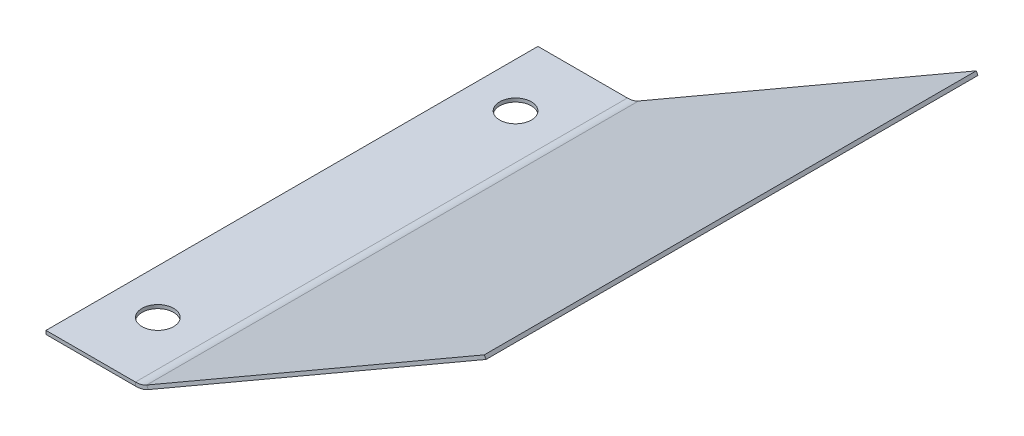
ISO-10303-21;
HEADER;
FILE_DESCRIPTION(('STEP AP214'),'2;1');
FILE_NAME('part.step','',(''),(''),'','','');
FILE_SCHEMA(('AUTOMOTIVE_DESIGN { 1 0 10303 214 1 1 1 1 }'));
ENDSEC;
DATA;
#1=APPLICATION_CONTEXT('core data for automotive mechanical design processes');
#2=APPLICATION_PROTOCOL_DEFINITION('international standard','automotive_design',2000,#1);
#3=PRODUCT_CONTEXT('',#1,'mechanical');
#4=PRODUCT('Part','Part','',(#3));
#5=PRODUCT_RELATED_PRODUCT_CATEGORY('part','',(#4));
#6=PRODUCT_DEFINITION_FORMATION('','',#4);
#7=PRODUCT_DEFINITION_CONTEXT('part definition',#1,'design');
#8=PRODUCT_DEFINITION('design','',#6,#7);
#9=PRODUCT_DEFINITION_SHAPE('','',#8);
#10=(LENGTH_UNIT() NAMED_UNIT(*) SI_UNIT(.MILLI.,.METRE.));
#11=(NAMED_UNIT(*) PLANE_ANGLE_UNIT() SI_UNIT($,.RADIAN.));
#12=(NAMED_UNIT(*) SI_UNIT($,.STERADIAN.) SOLID_ANGLE_UNIT());
#13=UNCERTAINTY_MEASURE_WITH_UNIT(LENGTH_MEASURE(1.E-05),#10,'distance_accuracy_value','');
#14=(GEOMETRIC_REPRESENTATION_CONTEXT(3) GLOBAL_UNCERTAINTY_ASSIGNED_CONTEXT((#13)) GLOBAL_UNIT_ASSIGNED_CONTEXT((#10,
#11,#12)) REPRESENTATION_CONTEXT('',''));
#15=CARTESIAN_POINT('',(0.,0.,0.));
#16=DIRECTION('',(0.,0.,1.));
#17=DIRECTION('',(1.,0.,0.));
#18=AXIS2_PLACEMENT_3D('',#15,#16,#17);
#19=CARTESIAN_POINT('',(0.,0.,0.));
#20=DIRECTION('',(0.,1.,0.));
#21=DIRECTION('',(0.,0.,1.));
#22=AXIS2_PLACEMENT_3D('',#19,#20,#21);
#23=PLANE('',#22);
#24=CARTESIAN_POINT('',(-6.34999999999999,0.,-60.325));
#25=DIRECTION('',(0.,-1.,0.));
#26=DIRECTION('',(0.,0.,-1.));
#27=AXIS2_PLACEMENT_3D('',#24,#25,#26);
#28=CIRCLE('',#27,2.2479);
#29=CARTESIAN_POINT('',(-6.34999999999999,0.,-62.5729));
#30=VERTEX_POINT('',#29);
#31=EDGE_CURVE('E219',#30,#30,#28,.T.);
#32=ORIENTED_EDGE('',*,*,#31,.F.);
#33=EDGE_LOOP('',(#32));
#34=FACE_BOUND('',#33,.T.);
#35=DIRECTION('',(0.,0.,1.));
#36=VECTOR('',#35,1.);
#37=CARTESIAN_POINT('',(0.,0.,0.));
#38=LINE('',#37,#36);
#39=CARTESIAN_POINT('',(0.,0.,0.));
#40=VERTEX_POINT('',#39);
#41=CARTESIAN_POINT('',(0.,0.,-69.85));
#42=VERTEX_POINT('',#41);
#43=EDGE_CURVE('E145',#40,#42,#38,.F.);
#44=ORIENTED_EDGE('',*,*,#43,.F.);
#45=DIRECTION('',(1.,0.,0.));
#46=VECTOR('',#45,1.);
#47=CARTESIAN_POINT('',(0.,0.,0.));
#48=LINE('',#47,#46);
#49=CARTESIAN_POINT('',(-12.7,0.,0.));
#50=VERTEX_POINT('',#49);
#51=EDGE_CURVE('E149',#50,#40,#48,.T.);
#52=ORIENTED_EDGE('',*,*,#51,.F.);
#53=DIRECTION('',(0.,0.,1.));
#54=VECTOR('',#53,1.);
#55=CARTESIAN_POINT('',(-12.7,0.,0.));
#56=LINE('',#55,#54);
#57=CARTESIAN_POINT('',(-12.7,0.,-69.85));
#58=VERTEX_POINT('',#57);
#59=EDGE_CURVE('E151',#58,#50,#56,.T.);
#60=ORIENTED_EDGE('',*,*,#59,.F.);
#61=DIRECTION('',(1.,0.,0.));
#62=VECTOR('',#61,1.);
#63=CARTESIAN_POINT('',(0.,0.,-69.85));
#64=LINE('',#63,#62);
#65=EDGE_CURVE('E113',#42,#58,#64,.F.);
#66=ORIENTED_EDGE('',*,*,#65,.F.);
#67=EDGE_LOOP('',(#44,#52,#60,#66));
#68=FACE_BOUND('',#67,.T.);
#69=CARTESIAN_POINT('',(-6.34999999999998,0.,-9.52499999999999));
#70=DIRECTION('',(0.,-1.,0.));
#71=DIRECTION('',(0.,0.,-1.));
#72=AXIS2_PLACEMENT_3D('',#69,#70,#71);
#73=CIRCLE('',#72,2.2479);
#74=CARTESIAN_POINT('',(-6.34999999999998,0.,-11.7729));
#75=VERTEX_POINT('',#74);
#76=EDGE_CURVE('E213',#75,#75,#73,.T.);
#77=ORIENTED_EDGE('',*,*,#76,.F.);
#78=EDGE_LOOP('',(#77));
#79=FACE_BOUND('',#78,.T.);
#80=ADVANCED_FACE('F72',(#34,#68,#79),#23,.F.);
#81=CARTESIAN_POINT('',(-12.7,0.508,0.));
#82=DIRECTION('',(-1.,0.,0.));
#83=DIRECTION('',(0.,0.,1.));
#84=AXIS2_PLACEMENT_3D('',#81,#82,#83);
#85=PLANE('',#84);
#86=DIRECTION('',(0.,1.,0.));
#87=VECTOR('',#86,1.);
#88=CARTESIAN_POINT('',(-12.7,0.508,-69.85));
#89=LINE('',#88,#87);
#90=CARTESIAN_POINT('',(-12.7,0.508,-69.85));
#91=VERTEX_POINT('',#90);
#92=EDGE_CURVE('E15',#58,#91,#89,.T.);
#93=ORIENTED_EDGE('',*,*,#92,.F.);
#94=ORIENTED_EDGE('',*,*,#59,.T.);
#95=DIRECTION('',(0.,1.,0.));
#96=VECTOR('',#95,1.);
#97=CARTESIAN_POINT('',(-12.7,0.508,0.));
#98=LINE('',#97,#96);
#99=CARTESIAN_POINT('',(-12.7,0.508,0.));
#100=VERTEX_POINT('',#99);
#101=EDGE_CURVE('E82',#50,#100,#98,.T.);
#102=ORIENTED_EDGE('',*,*,#101,.T.);
#103=DIRECTION('',(0.,0.,1.));
#104=VECTOR('',#103,1.);
#105=CARTESIAN_POINT('',(-12.7,0.508,0.));
#106=LINE('',#105,#104);
#107=EDGE_CURVE('E135',#91,#100,#106,.T.);
#108=ORIENTED_EDGE('',*,*,#107,.F.);
#109=EDGE_LOOP('',(#93,#94,#102,#108));
#110=FACE_BOUND('',#109,.T.);
#111=ADVANCED_FACE('F139',(#110),#85,.T.);
#112=CARTESIAN_POINT('',(0.,0.508,0.));
#113=DIRECTION('',(0.,0.,1.));
#114=DIRECTION('',(1.,0.,0.));
#115=AXIS2_PLACEMENT_3D('',#112,#113,#114);
#116=PLANE('',#115);
#117=ORIENTED_EDGE('',*,*,#101,.F.);
#118=ORIENTED_EDGE('',*,*,#51,.T.);
#119=DIRECTION('',(0.,1.,0.));
#120=VECTOR('',#119,1.);
#121=CARTESIAN_POINT('',(0.,0.508,0.));
#122=LINE('',#121,#120);
#123=CARTESIAN_POINT('',(0.,0.508,0.));
#124=VERTEX_POINT('',#123);
#125=EDGE_CURVE('E90',#40,#124,#122,.T.);
#126=ORIENTED_EDGE('',*,*,#125,.T.);
#127=DIRECTION('',(1.,0.,0.));
#128=VECTOR('',#127,1.);
#129=CARTESIAN_POINT('',(0.,0.508,0.));
#130=LINE('',#129,#128);
#131=EDGE_CURVE('E140',#100,#124,#130,.T.);
#132=ORIENTED_EDGE('',*,*,#131,.F.);
#133=EDGE_LOOP('',(#117,#118,#126,#132));
#134=FACE_BOUND('',#133,.T.);
#135=ADVANCED_FACE('F249',(#134),#116,.T.);
#136=CARTESIAN_POINT('',(0.,0.508,-69.85));
#137=DIRECTION('',(0.,0.,-1.));
#138=DIRECTION('',(-1.,0.,0.));
#139=AXIS2_PLACEMENT_3D('',#136,#137,#138);
#140=PLANE('',#139);
#141=ORIENTED_EDGE('',*,*,#65,.T.);
#142=ORIENTED_EDGE('',*,*,#92,.T.);
#143=DIRECTION('',(-1.,0.,0.));
#144=VECTOR('',#143,1.);
#145=CARTESIAN_POINT('',(0.,0.508,-69.85));
#146=LINE('',#145,#144);
#147=CARTESIAN_POINT('',(0.,0.508,-69.85));
#148=VERTEX_POINT('',#147);
#149=EDGE_CURVE('E130',#148,#91,#146,.T.);
#150=ORIENTED_EDGE('',*,*,#149,.F.);
#151=DIRECTION('',(0.,1.,0.));
#152=VECTOR('',#151,1.);
#153=CARTESIAN_POINT('',(0.,0.508,-69.85));
#154=LINE('',#153,#152);
#155=EDGE_CURVE('E76',#42,#148,#154,.T.);
#156=ORIENTED_EDGE('',*,*,#155,.F.);
#157=EDGE_LOOP('',(#141,#142,#150,#156));
#158=FACE_BOUND('',#157,.T.);
#159=ADVANCED_FACE('F74',(#158),#140,.T.);
#160=CARTESIAN_POINT('',(0.,0.508,0.));
#161=DIRECTION('',(0.,1.,0.));
#162=DIRECTION('',(0.,0.,1.));
#163=AXIS2_PLACEMENT_3D('',#160,#161,#162);
#164=PLANE('',#163);
#165=CARTESIAN_POINT('',(-6.34999999999999,0.508,-60.325));
#166=DIRECTION('',(0.,1.,0.));
#167=DIRECTION('',(0.,0.,1.));
#168=AXIS2_PLACEMENT_3D('',#165,#166,#167);
#169=CIRCLE('',#168,2.2479);
#170=CARTESIAN_POINT('',(-6.34999999999999,0.508,-58.0771));
#171=VERTEX_POINT('',#170);
#172=EDGE_CURVE('E216',#171,#171,#169,.T.);
#173=ORIENTED_EDGE('',*,*,#172,.F.);
#174=EDGE_LOOP('',(#173));
#175=FACE_BOUND('',#174,.T.);
#176=CARTESIAN_POINT('',(-6.34999999999998,0.508,-9.52499999999999));
#177=DIRECTION('',(0.,1.,0.));
#178=DIRECTION('',(0.,0.,1.));
#179=AXIS2_PLACEMENT_3D('',#176,#177,#178);
#180=CIRCLE('',#179,2.2479);
#181=CARTESIAN_POINT('',(-6.34999999999998,0.508,-7.27709999999999));
#182=VERTEX_POINT('',#181);
#183=EDGE_CURVE('E185',#182,#182,#180,.T.);
#184=ORIENTED_EDGE('',*,*,#183,.F.);
#185=EDGE_LOOP('',(#184));
#186=FACE_BOUND('',#185,.T.);
#187=DIRECTION('',(0.,0.,-1.));
#188=VECTOR('',#187,1.);
#189=CARTESIAN_POINT('',(0.,0.508,0.));
#190=LINE('',#189,#188);
#191=EDGE_CURVE('E137',#124,#148,#190,.T.);
#192=ORIENTED_EDGE('',*,*,#191,.T.);
#193=ORIENTED_EDGE('',*,*,#149,.T.);
#194=ORIENTED_EDGE('',*,*,#107,.T.);
#195=ORIENTED_EDGE('',*,*,#131,.T.);
#196=EDGE_LOOP('',(#192,#193,#194,#195));
#197=FACE_BOUND('',#196,.T.);
#198=ADVANCED_FACE('F134',(#175,#186,#197),#164,.T.);
#199=CARTESIAN_POINT('',(0.,3.683,0.));
#200=DIRECTION('',(0.,0.,1.));
#201=DIRECTION('',(0.,-1.,0.));
#202=AXIS2_PLACEMENT_3D('',#199,#200,#201);
#203=PLANE('',#202);
#204=DIRECTION('',(-0.499999999999995,0.866025403784442,0.));
#205=VECTOR('',#204,1.);
#206=CARTESIAN_POINT('',(1.84149999999997,0.493428437861901,0.));
#207=LINE('',#206,#205);
#208=CARTESIAN_POINT('',(1.58749999999999,0.933369342984402,0.));
#209=VERTEX_POINT('',#208);
#210=CARTESIAN_POINT('',(1.84149999999997,0.493428437861906,0.));
#211=VERTEX_POINT('',#210);
#212=EDGE_CURVE('E182',#209,#211,#207,.F.);
#213=ORIENTED_EDGE('',*,*,#212,.F.);
#214=CARTESIAN_POINT('',(0.,3.683,0.));
#215=DIRECTION('',(0.,0.,-1.));
#216=DIRECTION('',(0.,1.,0.));
#217=AXIS2_PLACEMENT_3D('',#214,#215,#216);
#218=CIRCLE('',#217,3.175);
#219=EDGE_CURVE('E171',#124,#209,#218,.F.);
#220=ORIENTED_EDGE('',*,*,#219,.F.);
#221=ORIENTED_EDGE('',*,*,#125,.F.);
#222=CARTESIAN_POINT('',(0.,3.683,0.));
#223=DIRECTION('',(0.,0.,-1.));
#224=DIRECTION('',(0.,1.,0.));
#225=AXIS2_PLACEMENT_3D('',#222,#223,#224);
#226=CIRCLE('',#225,3.683);
#227=EDGE_CURVE('E148',#40,#211,#226,.F.);
#228=ORIENTED_EDGE('',*,*,#227,.T.);
#229=EDGE_LOOP('',(#213,#220,#221,#228));
#230=FACE_BOUND('',#229,.T.);
#231=ADVANCED_FACE('F240',(#230),#203,.T.);
#232=CARTESIAN_POINT('',(0.,3.683,-69.85));
#233=DIRECTION('',(0.,0.,1.));
#234=DIRECTION('',(0.,-1.,0.));
#235=AXIS2_PLACEMENT_3D('',#232,#233,#234);
#236=PLANE('',#235);
#237=CARTESIAN_POINT('',(0.,3.683,-69.85));
#238=DIRECTION('',(0.,0.,-1.));
#239=DIRECTION('',(0.,1.,0.));
#240=AXIS2_PLACEMENT_3D('',#237,#238,#239);
#241=CIRCLE('',#240,3.175);
#242=CARTESIAN_POINT('',(1.58749999999999,0.933369342984397,-69.85));
#243=VERTEX_POINT('',#242);
#244=EDGE_CURVE('E161',#243,#148,#241,.T.);
#245=ORIENTED_EDGE('',*,*,#244,.F.);
#246=DIRECTION('',(-0.499999999999995,0.866025403784442,0.));
#247=VECTOR('',#246,1.);
#248=CARTESIAN_POINT('',(1.58749999999999,0.933369342984398,-69.85));
#249=LINE('',#248,#247);
#250=CARTESIAN_POINT('',(1.8415,0.493428437861905,-69.85));
#251=VERTEX_POINT('',#250);
#252=EDGE_CURVE('E187',#243,#251,#249,.F.);
#253=ORIENTED_EDGE('',*,*,#252,.T.);
#254=CARTESIAN_POINT('',(0.,3.683,-69.85));
#255=DIRECTION('',(0.,0.,-1.));
#256=DIRECTION('',(0.,1.,0.));
#257=AXIS2_PLACEMENT_3D('',#254,#255,#256);
#258=CIRCLE('',#257,3.683);
#259=EDGE_CURVE('E164',#251,#42,#258,.T.);
#260=ORIENTED_EDGE('',*,*,#259,.T.);
#261=ORIENTED_EDGE('',*,*,#155,.T.);
#262=EDGE_LOOP('',(#245,#253,#260,#261));
#263=FACE_BOUND('',#262,.T.);
#264=ADVANCED_FACE('F159',(#263),#236,.F.);
#265=CARTESIAN_POINT('',(0.,3.683,-69.85));
#266=DIRECTION('',(0.,0.,-1.));
#267=DIRECTION('',(0.499999999999995,-0.866025403784442,0.));
#268=AXIS2_PLACEMENT_3D('',#265,#266,#267);
#269=CYLINDRICAL_SURFACE('',#268,3.683);
#270=ORIENTED_EDGE('',*,*,#43,.T.);
#271=ORIENTED_EDGE('',*,*,#259,.F.);
#272=DIRECTION('',(0.,0.,-1.));
#273=VECTOR('',#272,1.);
#274=CARTESIAN_POINT('',(1.84149999999997,0.493428437861905,0.));
#275=LINE('',#274,#273);
#276=EDGE_CURVE('E189',#251,#211,#275,.F.);
#277=ORIENTED_EDGE('',*,*,#276,.T.);
#278=ORIENTED_EDGE('',*,*,#227,.F.);
#279=EDGE_LOOP('',(#270,#271,#277,#278));
#280=FACE_BOUND('',#279,.T.);
#281=ADVANCED_FACE('F292',(#280),#269,.T.);
#282=CARTESIAN_POINT('',(0.,3.683,-69.85));
#283=DIRECTION('',(0.,0.,-1.));
#284=DIRECTION('',(0.499999999999995,-0.866025403784442,0.));
#285=AXIS2_PLACEMENT_3D('',#282,#283,#284);
#286=CYLINDRICAL_SURFACE('',#285,3.175);
#287=ORIENTED_EDGE('',*,*,#191,.F.);
#288=ORIENTED_EDGE('',*,*,#219,.T.);
#289=DIRECTION('',(0.,0.,-1.));
#290=VECTOR('',#289,1.);
#291=CARTESIAN_POINT('',(1.58749999999999,0.933369342984402,0.));
#292=LINE('',#291,#290);
#293=EDGE_CURVE('E170',#209,#243,#292,.T.);
#294=ORIENTED_EDGE('',*,*,#293,.T.);
#295=ORIENTED_EDGE('',*,*,#244,.T.);
#296=EDGE_LOOP('',(#287,#288,#294,#295));
#297=FACE_BOUND('',#296,.T.);
#298=ADVANCED_FACE('F166',(#297),#286,.F.);
#299=CARTESIAN_POINT('',(49.784199837773,28.1731590948772,-69.85));
#300=DIRECTION('',(0.,0.,1.));
#301=DIRECTION('',(1.,0.,0.));
#302=AXIS2_PLACEMENT_3D('',#299,#300,#301);
#303=PLANE('',#302);
#304=ORIENTED_EDGE('',*,*,#252,.F.);
#305=DIRECTION('',(-0.866025403784442,-0.499999999999995,0.));
#306=VECTOR('',#305,1.);
#307=CARTESIAN_POINT('',(49.530199837773,28.6130999999997,-69.85));
#308=LINE('',#307,#306);
#309=CARTESIAN_POINT('',(49.530199837773,28.6130999999997,-69.85));
#310=VERTEX_POINT('',#309);
#311=EDGE_CURVE('E191',#243,#310,#308,.F.);
#312=ORIENTED_EDGE('',*,*,#311,.T.);
#313=DIRECTION('',(-0.499999999999995,0.866025403784442,0.));
#314=VECTOR('',#313,1.);
#315=CARTESIAN_POINT('',(49.784199837773,28.1731590948772,-69.85));
#316=LINE('',#315,#314);
#317=CARTESIAN_POINT('',(49.784199837773,28.1731590948772,-69.85));
#318=VERTEX_POINT('',#317);
#319=EDGE_CURVE('E172',#318,#310,#316,.T.);
#320=ORIENTED_EDGE('',*,*,#319,.F.);
#321=DIRECTION('',(0.866025403784442,0.499999999999995,0.));
#322=VECTOR('',#321,1.);
#323=CARTESIAN_POINT('',(0.884768233407551,-0.0589409051224901,-69.85));
#324=LINE('',#323,#322);
#325=EDGE_CURVE('E200',#251,#318,#324,.T.);
#326=ORIENTED_EDGE('',*,*,#325,.F.);
#327=EDGE_LOOP('',(#304,#312,#320,#326));
#328=FACE_BOUND('',#327,.T.);
#329=ADVANCED_FACE('F309',(#328),#303,.F.);
#330=CARTESIAN_POINT('',(1.1047386859688,0.0680590948775037,0.));
#331=DIRECTION('',(0.,0.,-1.));
#332=DIRECTION('',(-1.,0.,0.));
#333=AXIS2_PLACEMENT_3D('',#330,#331,#332);
#334=PLANE('',#333);
#335=ORIENTED_EDGE('',*,*,#212,.T.);
#336=DIRECTION('',(-0.866025403784442,-0.499999999999995,0.));
#337=VECTOR('',#336,1.);
#338=CARTESIAN_POINT('',(0.884768233407551,-0.0589409051224899,0.));
#339=LINE('',#338,#337);
#340=CARTESIAN_POINT('',(49.784199837773,28.1731590948772,0.));
#341=VERTEX_POINT('',#340);
#342=EDGE_CURVE('E206',#341,#211,#339,.T.);
#343=ORIENTED_EDGE('',*,*,#342,.F.);
#344=DIRECTION('',(-0.499999999999995,0.866025403784442,0.));
#345=VECTOR('',#344,1.);
#346=CARTESIAN_POINT('',(49.784199837773,28.1731590948772,0.));
#347=LINE('',#346,#345);
#348=CARTESIAN_POINT('',(49.5301998377731,28.6130999999997,0.));
#349=VERTEX_POINT('',#348);
#350=EDGE_CURVE('E176',#341,#349,#347,.T.);
#351=ORIENTED_EDGE('',*,*,#350,.T.);
#352=DIRECTION('',(0.866025403784442,0.499999999999995,0.));
#353=VECTOR('',#352,1.);
#354=CARTESIAN_POINT('',(0.850738685968799,0.508000000000004,0.));
#355=LINE('',#354,#353);
#356=EDGE_CURVE('E197',#349,#209,#355,.F.);
#357=ORIENTED_EDGE('',*,*,#356,.T.);
#358=EDGE_LOOP('',(#335,#343,#351,#357));
#359=FACE_BOUND('',#358,.T.);
#360=ADVANCED_FACE('F318',(#359),#334,.F.);
#361=CARTESIAN_POINT('',(0.884768233407551,-0.0589409051224899,0.));
#362=DIRECTION('',(-0.499999999999995,0.866025403784442,0.));
#363=DIRECTION('',(-0.866025403784442,-0.499999999999995,0.));
#364=AXIS2_PLACEMENT_3D('',#361,#362,#363);
#365=PLANE('',#364);
#366=ORIENTED_EDGE('',*,*,#276,.F.);
#367=ORIENTED_EDGE('',*,*,#325,.T.);
#368=DIRECTION('',(0.,0.,1.));
#369=VECTOR('',#368,1.);
#370=CARTESIAN_POINT('',(49.784199837773,28.1731590948772,0.));
#371=LINE('',#370,#369);
#372=EDGE_CURVE('E203',#318,#341,#371,.T.);
#373=ORIENTED_EDGE('',*,*,#372,.T.);
#374=ORIENTED_EDGE('',*,*,#342,.T.);
#375=EDGE_LOOP('',(#366,#367,#373,#374));
#376=FACE_BOUND('',#375,.T.);
#377=ADVANCED_FACE('F328',(#376),#365,.F.);
#378=CARTESIAN_POINT('',(0.630768233407547,0.381000000000006,0.));
#379=DIRECTION('',(-0.499999999999995,0.866025403784442,0.));
#380=DIRECTION('',(-0.866025403784442,-0.499999999999995,0.));
#381=AXIS2_PLACEMENT_3D('',#378,#379,#380);
#382=PLANE('',#381);
#383=ORIENTED_EDGE('',*,*,#311,.F.);
#384=ORIENTED_EDGE('',*,*,#293,.F.);
#385=ORIENTED_EDGE('',*,*,#356,.F.);
#386=DIRECTION('',(0.,0.,-1.));
#387=VECTOR('',#386,1.);
#388=CARTESIAN_POINT('',(49.5301998377731,28.6130999999997,0.));
#389=LINE('',#388,#387);
#390=EDGE_CURVE('E194',#310,#349,#389,.F.);
#391=ORIENTED_EDGE('',*,*,#390,.F.);
#392=EDGE_LOOP('',(#383,#384,#385,#391));
#393=FACE_BOUND('',#392,.T.);
#394=ADVANCED_FACE('F338',(#393),#382,.T.);
#395=CARTESIAN_POINT('',(49.784199837773,28.1731590948772,0.));
#396=DIRECTION('',(-0.866025403784442,-0.499999999999995,0.));
#397=DIRECTION('',(0.499999999999995,-0.866025403784442,0.));
#398=AXIS2_PLACEMENT_3D('',#395,#396,#397);
#399=PLANE('',#398);
#400=ORIENTED_EDGE('',*,*,#390,.T.);
#401=ORIENTED_EDGE('',*,*,#350,.F.);
#402=ORIENTED_EDGE('',*,*,#372,.F.);
#403=ORIENTED_EDGE('',*,*,#319,.T.);
#404=EDGE_LOOP('',(#400,#401,#402,#403));
#405=FACE_BOUND('',#404,.T.);
#406=ADVANCED_FACE('F235',(#405),#399,.F.);
#407=CARTESIAN_POINT('',(-6.34999999999998,0.,-9.52499999999999));
#408=DIRECTION('',(0.,-1.,0.));
#409=DIRECTION('',(0.,0.,-1.));
#410=AXIS2_PLACEMENT_3D('',#407,#408,#409);
#411=CYLINDRICAL_SURFACE('',#410,2.2479);
#412=ORIENTED_EDGE('',*,*,#76,.T.);
#413=EDGE_LOOP('',(#412));
#414=FACE_BOUND('',#413,.T.);
#415=ORIENTED_EDGE('',*,*,#183,.T.);
#416=EDGE_LOOP('',(#415));
#417=FACE_BOUND('',#416,.T.);
#418=ADVANCED_FACE('F232',(#414,#417),#411,.F.);
#419=CARTESIAN_POINT('',(-6.34999999999999,0.,-60.325));
#420=DIRECTION('',(0.,-1.,0.));
#421=DIRECTION('',(0.,0.,-1.));
#422=AXIS2_PLACEMENT_3D('',#419,#420,#421);
#423=CYLINDRICAL_SURFACE('',#422,2.2479);
#424=ORIENTED_EDGE('',*,*,#31,.T.);
#425=EDGE_LOOP('',(#424));
#426=FACE_BOUND('',#425,.T.);
#427=ORIENTED_EDGE('',*,*,#172,.T.);
#428=EDGE_LOOP('',(#427));
#429=FACE_BOUND('',#428,.T.);
#430=ADVANCED_FACE('F223',(#426,#429),#423,.F.);
#431=CLOSED_SHELL('',(#80,#111,#135,#159,#198,#231,#264,#281,#298,#329,#360,#377,#394,#406,#418,#430));
#432=MANIFOLD_SOLID_BREP('B2',#431);
#433=ADVANCED_BREP_SHAPE_REPRESENTATION('',(#18,#432),#14);
#434=SHAPE_DEFINITION_REPRESENTATION(#9,#433);
ENDSEC;
END-ISO-10303-21;
